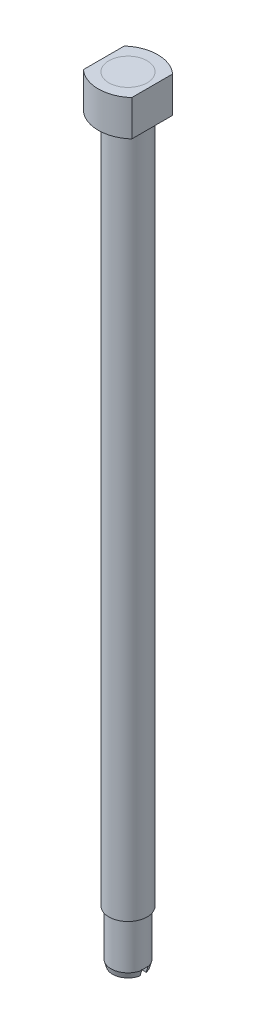
ISO-10303-21;
HEADER;
FILE_DESCRIPTION(('STEP AP214'),'2;1');
FILE_NAME('part.step','',(''),(''),'','','');
FILE_SCHEMA(('AUTOMOTIVE_DESIGN { 1 0 10303 214 1 1 1 1 }'));
ENDSEC;
DATA;
#1=APPLICATION_CONTEXT('core data for automotive mechanical design processes');
#2=APPLICATION_PROTOCOL_DEFINITION('international standard','automotive_design',2000,#1);
#3=PRODUCT_CONTEXT('',#1,'mechanical');
#4=PRODUCT('Part','Part','',(#3));
#5=PRODUCT_RELATED_PRODUCT_CATEGORY('part','',(#4));
#6=PRODUCT_DEFINITION_FORMATION('','',#4);
#7=PRODUCT_DEFINITION_CONTEXT('part definition',#1,'design');
#8=PRODUCT_DEFINITION('design','',#6,#7);
#9=PRODUCT_DEFINITION_SHAPE('','',#8);
#10=(LENGTH_UNIT() NAMED_UNIT(*) SI_UNIT(.MILLI.,.METRE.));
#11=(NAMED_UNIT(*) PLANE_ANGLE_UNIT() SI_UNIT($,.RADIAN.));
#12=(NAMED_UNIT(*) SI_UNIT($,.STERADIAN.) SOLID_ANGLE_UNIT());
#13=UNCERTAINTY_MEASURE_WITH_UNIT(LENGTH_MEASURE(1.E-05),#10,'distance_accuracy_value','');
#14=(GEOMETRIC_REPRESENTATION_CONTEXT(3) GLOBAL_UNCERTAINTY_ASSIGNED_CONTEXT((#13)) GLOBAL_UNIT_ASSIGNED_CONTEXT((#10,
#11,#12)) REPRESENTATION_CONTEXT('',''));
#15=CARTESIAN_POINT('',(0.,0.,0.));
#16=DIRECTION('',(0.,0.,1.));
#17=DIRECTION('',(1.,0.,0.));
#18=AXIS2_PLACEMENT_3D('',#15,#16,#17);
#19=CARTESIAN_POINT('',(0.,113.8174,1.08112685950414));
#20=DIRECTION('',(0.,1.,0.));
#21=DIRECTION('',(0.,0.,1.));
#22=AXIS2_PLACEMENT_3D('',#19,#20,#21);
#23=CYLINDRICAL_SURFACE('',#22,6.00872685950414);
#24=CARTESIAN_POINT('',(0.,119.761,1.08112685950414));
#25=DIRECTION('',(0.,1.,0.));
#26=DIRECTION('',(0.,0.,-1.));
#27=AXIS2_PLACEMENT_3D('',#24,#25,#26);
#28=CIRCLE('',#27,6.00872685950414);
#29=CARTESIAN_POINT('',(4.0132,119.761,-3.3909));
#30=VERTEX_POINT('',#29);
#31=CARTESIAN_POINT('',(-4.0132,119.761,-3.3909));
#32=VERTEX_POINT('',#31);
#33=EDGE_CURVE('E107',#30,#32,#28,.T.);
#34=ORIENTED_EDGE('',*,*,#33,.F.);
#35=DIRECTION('',(0.,1.,0.));
#36=VECTOR('',#35,1.);
#37=CARTESIAN_POINT('',(4.0132,113.8174,-3.3909));
#38=LINE('',#37,#36);
#39=CARTESIAN_POINT('',(4.0132,113.8174,-3.3909));
#40=VERTEX_POINT('',#39);
#41=EDGE_CURVE('E12',#40,#30,#38,.T.);
#42=ORIENTED_EDGE('',*,*,#41,.F.);
#43=CARTESIAN_POINT('',(0.,113.8174,1.08112685950414));
#44=DIRECTION('',(0.,1.,0.));
#45=DIRECTION('',(0.,0.,-1.));
#46=AXIS2_PLACEMENT_3D('',#43,#44,#45);
#47=CIRCLE('',#46,6.00872685950414);
#48=CARTESIAN_POINT('',(-4.0132,113.8174,-3.3909));
#49=VERTEX_POINT('',#48);
#50=EDGE_CURVE('E100',#40,#49,#47,.T.);
#51=ORIENTED_EDGE('',*,*,#50,.T.);
#52=DIRECTION('',(0.,1.,0.));
#53=VECTOR('',#52,1.);
#54=CARTESIAN_POINT('',(-4.0132,113.8174,-3.3909));
#55=LINE('',#54,#53);
#56=EDGE_CURVE('E45',#49,#32,#55,.T.);
#57=ORIENTED_EDGE('',*,*,#56,.T.);
#58=EDGE_LOOP('',(#34,#42,#51,#57));
#59=FACE_BOUND('',#58,.T.);
#60=ADVANCED_FACE('F42',(#59),#23,.T.);
#61=CARTESIAN_POINT('',(4.0132,113.8174,3.3909));
#62=DIRECTION('',(1.,0.,0.));
#63=DIRECTION('',(0.,0.,-1.));
#64=AXIS2_PLACEMENT_3D('',#61,#62,#63);
#65=PLANE('',#64);
#66=DIRECTION('',(0.,0.,-1.));
#67=VECTOR('',#66,1.);
#68=CARTESIAN_POINT('',(4.0132,119.761,3.3909));
#69=LINE('',#68,#67);
#70=CARTESIAN_POINT('',(4.0132,119.761,3.3909));
#71=VERTEX_POINT('',#70);
#72=EDGE_CURVE('E102',#71,#30,#69,.T.);
#73=ORIENTED_EDGE('',*,*,#72,.F.);
#74=DIRECTION('',(0.,1.,0.));
#75=VECTOR('',#74,1.);
#76=CARTESIAN_POINT('',(4.0132,113.8174,3.3909));
#77=LINE('',#76,#75);
#78=CARTESIAN_POINT('',(4.0132,113.8174,3.3909));
#79=VERTEX_POINT('',#78);
#80=EDGE_CURVE('E51',#79,#71,#77,.T.);
#81=ORIENTED_EDGE('',*,*,#80,.F.);
#82=DIRECTION('',(0.,0.,-1.));
#83=VECTOR('',#82,1.);
#84=CARTESIAN_POINT('',(4.0132,113.8174,3.3909));
#85=LINE('',#84,#83);
#86=EDGE_CURVE('E97',#79,#40,#85,.T.);
#87=ORIENTED_EDGE('',*,*,#86,.T.);
#88=ORIENTED_EDGE('',*,*,#41,.T.);
#89=EDGE_LOOP('',(#73,#81,#87,#88));
#90=FACE_BOUND('',#89,.T.);
#91=ADVANCED_FACE('F118',(#90),#65,.T.);
#92=CARTESIAN_POINT('',(0.,113.8174,-1.08112685950413));
#93=DIRECTION('',(0.,1.,0.));
#94=DIRECTION('',(0.,0.,1.));
#95=AXIS2_PLACEMENT_3D('',#92,#93,#94);
#96=CYLINDRICAL_SURFACE('',#95,6.00872685950413);
#97=CARTESIAN_POINT('',(0.,119.761,-1.08112685950413));
#98=DIRECTION('',(0.,1.,0.));
#99=DIRECTION('',(0.,0.,-1.));
#100=AXIS2_PLACEMENT_3D('',#97,#98,#99);
#101=CIRCLE('',#100,6.00872685950413);
#102=CARTESIAN_POINT('',(-4.0132,119.761,3.3909));
#103=VERTEX_POINT('',#102);
#104=EDGE_CURVE('E92',#103,#71,#101,.T.);
#105=ORIENTED_EDGE('',*,*,#104,.F.);
#106=DIRECTION('',(0.,1.,0.));
#107=VECTOR('',#106,1.);
#108=CARTESIAN_POINT('',(-4.0132,113.8174,3.3909));
#109=LINE('',#108,#107);
#110=CARTESIAN_POINT('',(-4.0132,113.8174,3.3909));
#111=VERTEX_POINT('',#110);
#112=EDGE_CURVE('E87',#111,#103,#109,.T.);
#113=ORIENTED_EDGE('',*,*,#112,.F.);
#114=CARTESIAN_POINT('',(0.,113.8174,-1.08112685950413));
#115=DIRECTION('',(0.,1.,0.));
#116=DIRECTION('',(0.,0.,-1.));
#117=AXIS2_PLACEMENT_3D('',#114,#115,#116);
#118=CIRCLE('',#117,6.00872685950413);
#119=EDGE_CURVE('E90',#111,#79,#118,.T.);
#120=ORIENTED_EDGE('',*,*,#119,.T.);
#121=ORIENTED_EDGE('',*,*,#80,.T.);
#122=EDGE_LOOP('',(#105,#113,#120,#121));
#123=FACE_BOUND('',#122,.T.);
#124=ADVANCED_FACE('F89',(#123),#96,.T.);
#125=CARTESIAN_POINT('',(-4.0132,113.8174,3.3909));
#126=DIRECTION('',(-1.,0.,0.));
#127=DIRECTION('',(0.,0.,1.));
#128=AXIS2_PLACEMENT_3D('',#125,#126,#127);
#129=PLANE('',#128);
#130=DIRECTION('',(0.,0.,1.));
#131=VECTOR('',#130,1.);
#132=CARTESIAN_POINT('',(-4.0132,119.761,3.3909));
#133=LINE('',#132,#131);
#134=EDGE_CURVE('E110',#32,#103,#133,.T.);
#135=ORIENTED_EDGE('',*,*,#134,.F.);
#136=ORIENTED_EDGE('',*,*,#56,.F.);
#137=DIRECTION('',(0.,0.,1.));
#138=VECTOR('',#137,1.);
#139=CARTESIAN_POINT('',(-4.0132,113.8174,3.3909));
#140=LINE('',#139,#138);
#141=EDGE_CURVE('E96',#49,#111,#140,.T.);
#142=ORIENTED_EDGE('',*,*,#141,.T.);
#143=ORIENTED_EDGE('',*,*,#112,.T.);
#144=EDGE_LOOP('',(#135,#136,#142,#143));
#145=FACE_BOUND('',#144,.T.);
#146=ADVANCED_FACE('F99',(#145),#129,.T.);
#147=CARTESIAN_POINT('',(0.,113.8174,1.08112685950414));
#148=DIRECTION('',(0.,-1.,0.));
#149=DIRECTION('',(0.,0.,-1.));
#150=AXIS2_PLACEMENT_3D('',#147,#148,#149);
#151=PLANE('',#150);
#152=CARTESIAN_POINT('',(0.,113.8174,0.));
#153=DIRECTION('',(0.,1.,0.));
#154=DIRECTION('',(0.,0.,1.));
#155=AXIS2_PLACEMENT_3D('',#152,#153,#154);
#156=CIRCLE('',#155,3.175);
#157=CARTESIAN_POINT('',(0.,113.8174,3.175));
#158=VERTEX_POINT('',#157);
#159=EDGE_CURVE('E111',#158,#158,#156,.T.);
#160=ORIENTED_EDGE('',*,*,#159,.T.);
#161=EDGE_LOOP('',(#160));
#162=FACE_BOUND('',#161,.T.);
#163=ORIENTED_EDGE('',*,*,#50,.F.);
#164=ORIENTED_EDGE('',*,*,#86,.F.);
#165=ORIENTED_EDGE('',*,*,#119,.F.);
#166=ORIENTED_EDGE('',*,*,#141,.F.);
#167=EDGE_LOOP('',(#163,#164,#165,#166));
#168=FACE_BOUND('',#167,.T.);
#169=ADVANCED_FACE('F95',(#162,#168),#151,.T.);
#170=CARTESIAN_POINT('',(0.,119.761,1.08112685950414));
#171=DIRECTION('',(0.,-1.,0.));
#172=DIRECTION('',(0.,0.,-1.));
#173=AXIS2_PLACEMENT_3D('',#170,#171,#172);
#174=PLANE('',#173);
#175=CARTESIAN_POINT('',(0.,119.761,0.));
#176=DIRECTION('',(0.,1.,0.));
#177=DIRECTION('',(0.,0.,1.));
#178=AXIS2_PLACEMENT_3D('',#175,#176,#177);
#179=CIRCLE('',#178,3.175);
#180=CARTESIAN_POINT('',(0.,119.761,3.175));
#181=VERTEX_POINT('',#180);
#182=EDGE_CURVE('E148',#181,#181,#179,.T.);
#183=ORIENTED_EDGE('',*,*,#182,.F.);
#184=EDGE_LOOP('',(#183));
#185=FACE_BOUND('',#184,.T.);
#186=ORIENTED_EDGE('',*,*,#33,.T.);
#187=ORIENTED_EDGE('',*,*,#134,.T.);
#188=ORIENTED_EDGE('',*,*,#104,.T.);
#189=ORIENTED_EDGE('',*,*,#72,.T.);
#190=EDGE_LOOP('',(#186,#187,#188,#189));
#191=FACE_BOUND('',#190,.T.);
#192=ADVANCED_FACE('F117',(#185,#191),#174,.F.);
#193=CARTESIAN_POINT('',(0.,113.8174,0.));
#194=DIRECTION('',(0.,1.,0.));
#195=DIRECTION('',(0.,0.,1.));
#196=AXIS2_PLACEMENT_3D('',#193,#194,#195);
#197=CYLINDRICAL_SURFACE('',#196,3.175);
#198=ORIENTED_EDGE('',*,*,#159,.F.);
#199=EDGE_LOOP('',(#198));
#200=FACE_BOUND('',#199,.T.);
#201=ORIENTED_EDGE('',*,*,#182,.T.);
#202=EDGE_LOOP('',(#201));
#203=FACE_BOUND('',#202,.T.);
#204=ADVANCED_FACE('F136',(#200,#203),#197,.F.);
#205=CLOSED_SHELL('',(#60,#91,#124,#146,#169,#192,#204));
#206=MANIFOLD_SOLID_BREP('B2',#205);
#207=CARTESIAN_POINT('',(0.,-7.62,0.));
#208=DIRECTION('',(0.,1.,0.));
#209=DIRECTION('',(0.,0.,1.));
#210=AXIS2_PLACEMENT_3D('',#207,#208,#209);
#211=CYLINDRICAL_SURFACE('',#210,2.82287299658198);
#212=CARTESIAN_POINT('',(0.,0.,0.));
#213=DIRECTION('',(0.,1.,0.));
#214=DIRECTION('',(0.,0.,1.));
#215=AXIS2_PLACEMENT_3D('',#212,#213,#214);
#216=CIRCLE('',#215,2.82287299658198);
#217=CARTESIAN_POINT('',(0.,0.,2.82287299658198));
#218=VERTEX_POINT('',#217);
#219=EDGE_CURVE('E269',#218,#218,#216,.F.);
#220=ORIENTED_EDGE('',*,*,#219,.T.);
#221=EDGE_LOOP('',(#220));
#222=FACE_BOUND('',#221,.T.);
#223=DIRECTION('',(0.,1.,0.));
#224=VECTOR('',#223,1.);
#225=CARTESIAN_POINT('',(2.77678734418603,-7.62,-0.508));
#226=LINE('',#225,#224);
#227=CARTESIAN_POINT('',(2.77678734418603,-7.62,-0.508));
#228=VERTEX_POINT('',#227);
#229=CARTESIAN_POINT('',(2.77678734418603,-7.52654586270144,-0.508));
#230=VERTEX_POINT('',#229);
#231=EDGE_CURVE('E312',#228,#230,#226,.T.);
#232=ORIENTED_EDGE('',*,*,#231,.F.);
#233=CARTESIAN_POINT('',(0.,-7.62,0.));
#234=DIRECTION('',(0.,-1.,0.));
#235=DIRECTION('',(0.,0.,-1.));
#236=AXIS2_PLACEMENT_3D('',#233,#234,#235);
#237=CIRCLE('',#236,2.82287299658198);
#238=CARTESIAN_POINT('',(-2.77678734418603,-7.62,-0.508000000000002));
#239=VERTEX_POINT('',#238);
#240=EDGE_CURVE('E254',#239,#228,#237,.T.);
#241=ORIENTED_EDGE('',*,*,#240,.F.);
#242=DIRECTION('',(0.,1.,0.));
#243=VECTOR('',#242,1.);
#244=CARTESIAN_POINT('',(-2.77678734418603,-7.62,-0.508000000000002));
#245=LINE('',#244,#243);
#246=CARTESIAN_POINT('',(-2.77678734418603,-7.52654586270144,-0.508000000000002));
#247=VERTEX_POINT('',#246);
#248=EDGE_CURVE('E209',#247,#239,#245,.F.);
#249=ORIENTED_EDGE('',*,*,#248,.F.);
#250=CARTESIAN_POINT('',(0.,-7.52654586270144,0.));
#251=DIRECTION('',(0.,-1.,0.));
#252=DIRECTION('',(0.,0.,-1.));
#253=AXIS2_PLACEMENT_3D('',#250,#251,#252);
#254=CIRCLE('',#253,2.82287299658198);
#255=CARTESIAN_POINT('',(-2.77678734418603,-7.52654586270144,0.507999999999998));
#256=VERTEX_POINT('',#255);
#257=EDGE_CURVE('E190',#256,#247,#254,.T.);
#258=ORIENTED_EDGE('',*,*,#257,.F.);
#259=DIRECTION('',(0.,1.,0.));
#260=VECTOR('',#259,1.);
#261=CARTESIAN_POINT('',(-2.77678734418603,-7.62,0.507999999999998));
#262=LINE('',#261,#260);
#263=CARTESIAN_POINT('',(-2.77678734418603,-7.62,0.507999999999998));
#264=VERTEX_POINT('',#263);
#265=EDGE_CURVE('E314',#264,#256,#262,.T.);
#266=ORIENTED_EDGE('',*,*,#265,.F.);
#267=CARTESIAN_POINT('',(2.77678734418603,-7.62,0.508));
#268=VERTEX_POINT('',#267);
#269=EDGE_CURVE('E260',#268,#264,#237,.T.);
#270=ORIENTED_EDGE('',*,*,#269,.F.);
#271=DIRECTION('',(0.,1.,0.));
#272=VECTOR('',#271,1.);
#273=CARTESIAN_POINT('',(2.77678734418603,-7.62,0.508));
#274=LINE('',#273,#272);
#275=CARTESIAN_POINT('',(2.77678734418603,-7.52654586270144,0.508));
#276=VERTEX_POINT('',#275);
#277=EDGE_CURVE('E201',#276,#268,#274,.F.);
#278=ORIENTED_EDGE('',*,*,#277,.F.);
#279=EDGE_CURVE('E40',#230,#276,#254,.T.);
#280=ORIENTED_EDGE('',*,*,#279,.F.);
#281=EDGE_LOOP('',(#232,#241,#249,#258,#266,#270,#278,#280));
#282=FACE_BOUND('',#281,.T.);
#283=ADVANCED_FACE('F186',(#222,#282),#211,.T.);
#284=CARTESIAN_POINT('',(0.,-8.54254586270144,-2.56046475852982));
#285=DIRECTION('',(0.,1.,0.));
#286=DIRECTION('',(0.,0.,1.));
#287=AXIS2_PLACEMENT_3D('',#284,#285,#286);
#288=PLANE('',#287);
#289=DIRECTION('',(-1.,0.,0.));
#290=VECTOR('',#289,1.);
#291=CARTESIAN_POINT('',(0.,-8.54254586270144,-0.508000000000001));
#292=LINE('',#291,#290);
#293=CARTESIAN_POINT('',(2.50956485863051,-8.54254586270144,-0.508));
#294=VERTEX_POINT('',#293);
#295=CARTESIAN_POINT('',(-2.50956485863051,-8.54254586270144,-0.508000000000002));
#296=VERTEX_POINT('',#295);
#297=EDGE_CURVE('E238',#294,#296,#292,.T.);
#298=ORIENTED_EDGE('',*,*,#297,.T.);
#299=CARTESIAN_POINT('',(0.,-8.54254586270144,0.));
#300=DIRECTION('',(0.,1.,0.));
#301=DIRECTION('',(0.,0.,1.));
#302=AXIS2_PLACEMENT_3D('',#299,#300,#301);
#303=CIRCLE('',#302,2.56046475852982);
#304=EDGE_CURVE('E252',#294,#296,#303,.T.);
#305=ORIENTED_EDGE('',*,*,#304,.F.);
#306=EDGE_LOOP('',(#298,#305));
#307=FACE_BOUND('',#306,.T.);
#308=ADVANCED_FACE('F257',(#307),#288,.F.);
#309=DIRECTION('',(1.,0.,0.));
#310=VECTOR('',#309,1.);
#311=CARTESIAN_POINT('',(0.,-8.54254586270144,0.507999999999999));
#312=LINE('',#311,#310);
#313=CARTESIAN_POINT('',(-2.50956485863051,-8.54254586270144,0.507999999999998));
#314=VERTEX_POINT('',#313);
#315=CARTESIAN_POINT('',(2.50956485863051,-8.54254586270144,0.508));
#316=VERTEX_POINT('',#315);
#317=EDGE_CURVE('E247',#314,#316,#312,.T.);
#318=ORIENTED_EDGE('',*,*,#317,.T.);
#319=EDGE_CURVE('E258',#314,#316,#303,.T.);
#320=ORIENTED_EDGE('',*,*,#319,.F.);
#321=EDGE_LOOP('',(#318,#320));
#322=FACE_BOUND('',#321,.T.);
#323=ADVANCED_FACE('F327',(#322),#288,.F.);
#324=CARTESIAN_POINT('',(0.,-8.54254586270144,0.));
#325=DIRECTION('',(0.,1.,0.));
#326=DIRECTION('',(0.,0.,1.));
#327=AXIS2_PLACEMENT_3D('',#324,#325,#326);
#328=CONICAL_SURFACE('',#327,2.56046475852982,0.277120440521634);
#329=CARTESIAN_POINT('',(-3.75509140315342,-4.22235165635554,-0.508000000000002));
#330=CARTESIAN_POINT('',(-3.65936682493509,-4.55585016428542,-0.508000000000002));
#331=CARTESIAN_POINT('',(-3.56358296039658,-4.88933163204708,-0.508000000000002));
#332=CARTESIAN_POINT('',(-3.3718598473048,-5.556250045758,-0.508000000000002));
#333=CARTESIAN_POINT('',(-3.27592059868678,-5.88968699168865,-0.508000000000002));
#334=CARTESIAN_POINT('',(-2.98781619232924,-6.88990971485257,-0.508000000000002));
#335=CARTESIAN_POINT('',(-2.79536286716091,-7.55661263186235,-0.508000000000002));
#336=CARTESIAN_POINT('',(-2.50562147958881,-8.55636317439185,-0.508000000000002));
#337=CARTESIAN_POINT('',(-2.40886362574041,-8.88956439846464,-0.508000000000002));
#338=CARTESIAN_POINT('',(-2.2148353637309,-9.5558170416463,-0.508000000000002));
#339=CARTESIAN_POINT('',(-2.11756495643144,-9.88886846100597,-0.508000000000002));
#340=CARTESIAN_POINT('',(-1.92226602735175,-10.5547524487921,-0.508000000000002));
#341=CARTESIAN_POINT('',(-1.82423749908121,-10.8875850153183,-0.508000000000002));
#342=CARTESIAN_POINT('',(-1.67628477373254,-11.3865652700007,-0.508000000000001));
#343=CARTESIAN_POINT('',(-1.62681540384984,-11.5528477192207,-0.508000000000001));
#344=CARTESIAN_POINT('',(-1.52746791254534,-11.8852908187634,-0.508000000000001));
#345=CARTESIAN_POINT('',(-1.47758979022123,-12.0514514688163,-0.508000000000001));
#346=CARTESIAN_POINT('',(-1.42745463611057,-12.2175348735893,-0.508000000000001));
#347=B_SPLINE_CURVE_WITH_KNOTS('',3,(#329,#330,#331,#332,#333,#334,#335,#336,#337,#338,#339,
#340,#341,#342,#343,#344,#345,#346),.UNSPECIFIED.,.F.,.F.,(4,2,2,2,2,2,2,2,4),(0.,
1.04089381012012,2.08178805408325,4.16356014334497,5.20445670209373,6.24535151154004,
7.28625524202892,7.8067100111497,8.32716592947246),.UNSPECIFIED.);
#348=EDGE_CURVE('E243',#239,#296,#347,.T.);
#349=ORIENTED_EDGE('',*,*,#348,.F.);
#350=ORIENTED_EDGE('',*,*,#240,.T.);
#351=CARTESIAN_POINT('',(1.42745463611057,-12.2175348735893,-0.508));
#352=CARTESIAN_POINT('',(1.48475272474168,-12.027710521842,-0.508));
#353=CARTESIAN_POINT('',(1.54171983668693,-11.8377867976167,-0.508));
#354=CARTESIAN_POINT('',(1.65513968029623,-11.4577863075059,-0.508));
#355=CARTESIAN_POINT('',(1.71159241335101,-11.2677095420357,-0.508));
#356=CARTESIAN_POINT('',(1.88040010683767,-10.6973192563528,-0.508));
#357=CARTESIAN_POINT('',(1.9922053288376,-10.3168431906479,-0.508));
#358=CARTESIAN_POINT('',(2.18708464901405,-9.65083688679143,-0.508));
#359=CARTESIAN_POINT('',(2.2703501169459,-9.36536251787649,-0.508));
#360=CARTESIAN_POINT('',(2.43652118293803,-8.79430821577355,-0.508));
#361=CARTESIAN_POINT('',(2.51942678002231,-8.50872828230153,-0.508));
#362=CARTESIAN_POINT('',(2.79536425817509,-7.55660737417558,-0.508));
#363=CARTESIAN_POINT('',(2.98781918626591,-6.88989925266861,-0.508));
#364=CARTESIAN_POINT('',(3.27592437325797,-5.88967392185149,-0.508));
#365=CARTESIAN_POINT('',(3.37186286139037,-5.5562395885999,-0.508));
#366=CARTESIAN_POINT('',(3.56358445634995,-4.88932640075561,-0.508));
#367=CARTESIAN_POINT('',(3.65936756324175,-4.55584754618148,-0.508));
#368=CARTESIAN_POINT('',(3.75509140315342,-4.22235165635554,-0.508));
#369=B_SPLINE_CURVE_WITH_KNOTS('',3,(#351,#352,#353,#354,#355,#356,#357,#358,#359,#360,#361,
#362,#363,#364,#365,#366,#367,#368),.UNSPECIFIED.,.F.,.F.,(4,2,2,2,2,2,2,2,4),(0.,
0.59484952784476,1.18969744692898,2.37938527852458,3.2714942778291,4.16360569508374,
6.24539410877855,7.28628019007867,8.32716583842488),.UNSPECIFIED.);
#370=EDGE_CURVE('E241',#294,#228,#369,.T.);
#371=ORIENTED_EDGE('',*,*,#370,.F.);
#372=ORIENTED_EDGE('',*,*,#304,.T.);
#373=EDGE_LOOP('',(#349,#350,#371,#372));
#374=FACE_BOUND('',#373,.T.);
#375=ADVANCED_FACE('F251',(#374),#328,.T.);
#376=CARTESIAN_POINT('',(-1.42745463611057,-12.2175348735893,0.507999999999999));
#377=CARTESIAN_POINT('',(-1.48475272474168,-12.027710521842,0.507999999999999));
#378=CARTESIAN_POINT('',(-1.54171983668693,-11.8377867976167,0.507999999999999));
#379=CARTESIAN_POINT('',(-1.65513968029623,-11.4577863075059,0.507999999999999));
#380=CARTESIAN_POINT('',(-1.71159241335101,-11.2677095420357,0.507999999999999));
#381=CARTESIAN_POINT('',(-1.88040010683767,-10.6973192563528,0.507999999999999));
#382=CARTESIAN_POINT('',(-1.9922053288376,-10.3168431906479,0.507999999999999));
#383=CARTESIAN_POINT('',(-2.18708464901405,-9.65083688679143,0.507999999999999));
#384=CARTESIAN_POINT('',(-2.2703501169459,-9.36536251787649,0.507999999999998));
#385=CARTESIAN_POINT('',(-2.43652118293803,-8.79430821577355,0.507999999999998));
#386=CARTESIAN_POINT('',(-2.51942678002231,-8.50872828230153,0.507999999999998));
#387=CARTESIAN_POINT('',(-2.79536425817509,-7.55660737417558,0.507999999999998));
#388=CARTESIAN_POINT('',(-2.98781918626591,-6.88989925266861,0.507999999999998));
#389=CARTESIAN_POINT('',(-3.27592437325797,-5.88967392185149,0.507999999999998));
#390=CARTESIAN_POINT('',(-3.37186286139037,-5.5562395885999,0.507999999999998));
#391=CARTESIAN_POINT('',(-3.56358445634995,-4.88932640075561,0.507999999999998));
#392=CARTESIAN_POINT('',(-3.65936756324175,-4.55584754618148,0.507999999999998));
#393=CARTESIAN_POINT('',(-3.75509140315342,-4.22235165635554,0.507999999999998));
#394=B_SPLINE_CURVE_WITH_KNOTS('',3,(#376,#377,#378,#379,#380,#381,#382,#383,#384,#385,#386,
#387,#388,#389,#390,#391,#392,#393),.UNSPECIFIED.,.F.,.F.,(4,2,2,2,2,2,2,2,4),(0.,
0.59484952784476,1.18969744692898,2.37938527852458,3.2714942778291,4.16360569508374,
6.24539410877855,7.28628019007867,8.32716583842488),.UNSPECIFIED.);
#395=EDGE_CURVE('E255',#314,#264,#394,.T.);
#396=ORIENTED_EDGE('',*,*,#395,.F.);
#397=ORIENTED_EDGE('',*,*,#319,.T.);
#398=CARTESIAN_POINT('',(3.75509140315342,-4.22235165635554,0.508));
#399=CARTESIAN_POINT('',(3.65936682493509,-4.55585016428542,0.508));
#400=CARTESIAN_POINT('',(3.56358296039658,-4.88933163204708,0.508));
#401=CARTESIAN_POINT('',(3.3718598473048,-5.556250045758,0.508));
#402=CARTESIAN_POINT('',(3.27592059868678,-5.88968699168865,0.508));
#403=CARTESIAN_POINT('',(2.98781619232924,-6.88990971485257,0.508));
#404=CARTESIAN_POINT('',(2.79536286716091,-7.55661263186235,0.508));
#405=CARTESIAN_POINT('',(2.50562147958881,-8.55636317439185,0.508));
#406=CARTESIAN_POINT('',(2.40886362574041,-8.88956439846464,0.508));
#407=CARTESIAN_POINT('',(2.2148353637309,-9.5558170416463,0.508));
#408=CARTESIAN_POINT('',(2.11756495643144,-9.88886846100597,0.508));
#409=CARTESIAN_POINT('',(1.92226602735175,-10.5547524487921,0.508));
#410=CARTESIAN_POINT('',(1.82423749908122,-10.8875850153183,0.508));
#411=CARTESIAN_POINT('',(1.67628477373254,-11.3865652700007,0.508));
#412=CARTESIAN_POINT('',(1.62681540384984,-11.5528477192207,0.508));
#413=CARTESIAN_POINT('',(1.52746791254534,-11.8852908187634,0.508));
#414=CARTESIAN_POINT('',(1.47758979022123,-12.0514514688163,0.508));
#415=CARTESIAN_POINT('',(1.42745463611057,-12.2175348735893,0.508));
#416=B_SPLINE_CURVE_WITH_KNOTS('',3,(#398,#399,#400,#401,#402,#403,#404,#405,#406,#407,#408,
#409,#410,#411,#412,#413,#414,#415),.UNSPECIFIED.,.F.,.F.,(4,2,2,2,2,2,2,2,4),(0.,
1.04089381012012,2.08178805408325,4.16356014334497,5.20445670209373,6.24535151154004,
7.28625524202892,7.80671001114969,8.32716592947246),.UNSPECIFIED.);
#417=EDGE_CURVE('E275',#268,#316,#416,.T.);
#418=ORIENTED_EDGE('',*,*,#417,.F.);
#419=ORIENTED_EDGE('',*,*,#269,.T.);
#420=EDGE_LOOP('',(#396,#397,#418,#419));
#421=FACE_BOUND('',#420,.T.);
#422=ADVANCED_FACE('F324',(#421),#328,.T.);
#423=CARTESIAN_POINT('',(0.,119.761,0.));
#424=DIRECTION('',(0.,-1.,0.));
#425=DIRECTION('',(0.,0.,-1.));
#426=AXIS2_PLACEMENT_3D('',#423,#424,#425);
#427=CYLINDRICAL_SURFACE('',#426,3.175);
#428=CARTESIAN_POINT('',(0.,119.761,0.));
#429=DIRECTION('',(0.,1.,0.));
#430=DIRECTION('',(0.,0.,1.));
#431=AXIS2_PLACEMENT_3D('',#428,#429,#430);
#432=CIRCLE('',#431,3.175);
#433=CARTESIAN_POINT('',(0.,119.761,3.175));
#434=VERTEX_POINT('',#433);
#435=EDGE_CURVE('E266',#434,#434,#432,.T.);
#436=ORIENTED_EDGE('',*,*,#435,.F.);
#437=EDGE_LOOP('',(#436));
#438=FACE_BOUND('',#437,.T.);
#439=CARTESIAN_POINT('',(0.,0.,0.));
#440=DIRECTION('',(0.,1.,0.));
#441=DIRECTION('',(0.,0.,1.));
#442=AXIS2_PLACEMENT_3D('',#439,#440,#441);
#443=CIRCLE('',#442,3.175);
#444=CARTESIAN_POINT('',(0.,0.,3.175));
#445=VERTEX_POINT('',#444);
#446=EDGE_CURVE('E270',#445,#445,#443,.T.);
#447=ORIENTED_EDGE('',*,*,#446,.T.);
#448=EDGE_LOOP('',(#447));
#449=FACE_BOUND('',#448,.T.);
#450=ADVANCED_FACE('F188',(#438,#449),#427,.T.);
#451=CARTESIAN_POINT('',(0.,119.761,0.));
#452=DIRECTION('',(0.,1.,0.));
#453=DIRECTION('',(0.,0.,1.));
#454=AXIS2_PLACEMENT_3D('',#451,#452,#453);
#455=PLANE('',#454);
#456=ORIENTED_EDGE('',*,*,#435,.T.);
#457=EDGE_LOOP('',(#456));
#458=FACE_BOUND('',#457,.T.);
#459=ADVANCED_FACE('F339',(#458),#455,.T.);
#460=CARTESIAN_POINT('',(0.,0.,0.));
#461=DIRECTION('',(0.,1.,0.));
#462=DIRECTION('',(0.,0.,1.));
#463=AXIS2_PLACEMENT_3D('',#460,#461,#462);
#464=PLANE('',#463);
#465=ORIENTED_EDGE('',*,*,#219,.F.);
#466=EDGE_LOOP('',(#465));
#467=FACE_BOUND('',#466,.T.);
#468=ORIENTED_EDGE('',*,*,#446,.F.);
#469=EDGE_LOOP('',(#468));
#470=FACE_BOUND('',#469,.T.);
#471=ADVANCED_FACE('F341',(#467,#470),#464,.F.);
#472=CARTESIAN_POINT('',(0.,-7.52654586270144,0.));
#473=DIRECTION('',(0.,-1.,0.));
#474=DIRECTION('',(0.,0.,-1.));
#475=AXIS2_PLACEMENT_3D('',#472,#473,#474);
#476=PLANE('',#475);
#477=ORIENTED_EDGE('',*,*,#279,.T.);
#478=DIRECTION('',(1.,0.,0.));
#479=VECTOR('',#478,1.);
#480=CARTESIAN_POINT('',(0.,-7.52654586270144,0.507999999999999));
#481=LINE('',#480,#479);
#482=EDGE_CURVE('E309',#256,#276,#481,.T.);
#483=ORIENTED_EDGE('',*,*,#482,.F.);
#484=ORIENTED_EDGE('',*,*,#257,.T.);
#485=DIRECTION('',(-1.,0.,0.));
#486=VECTOR('',#485,1.);
#487=CARTESIAN_POINT('',(0.,-7.52654586270144,-0.508000000000001));
#488=LINE('',#487,#486);
#489=EDGE_CURVE('E307',#230,#247,#488,.T.);
#490=ORIENTED_EDGE('',*,*,#489,.F.);
#491=EDGE_LOOP('',(#477,#483,#484,#490));
#492=FACE_BOUND('',#491,.T.);
#493=ADVANCED_FACE('F292',(#492),#476,.T.);
#494=CARTESIAN_POINT('',(0.,-7.52654586270144,-0.508000000000001));
#495=DIRECTION('',(0.,0.,1.));
#496=DIRECTION('',(1.,0.,0.));
#497=AXIS2_PLACEMENT_3D('',#494,#495,#496);
#498=PLANE('',#497);
#499=ORIENTED_EDGE('',*,*,#248,.T.);
#500=ORIENTED_EDGE('',*,*,#348,.T.);
#501=ORIENTED_EDGE('',*,*,#297,.F.);
#502=ORIENTED_EDGE('',*,*,#370,.T.);
#503=ORIENTED_EDGE('',*,*,#231,.T.);
#504=ORIENTED_EDGE('',*,*,#489,.T.);
#505=EDGE_LOOP('',(#499,#500,#501,#502,#503,#504));
#506=FACE_BOUND('',#505,.T.);
#507=ADVANCED_FACE('F240',(#506),#498,.T.);
#508=CARTESIAN_POINT('',(0.,-7.52654586270144,0.507999999999999));
#509=DIRECTION('',(0.,0.,-1.));
#510=DIRECTION('',(-1.,0.,0.));
#511=AXIS2_PLACEMENT_3D('',#508,#509,#510);
#512=PLANE('',#511);
#513=ORIENTED_EDGE('',*,*,#265,.T.);
#514=ORIENTED_EDGE('',*,*,#482,.T.);
#515=ORIENTED_EDGE('',*,*,#277,.T.);
#516=ORIENTED_EDGE('',*,*,#417,.T.);
#517=ORIENTED_EDGE('',*,*,#317,.F.);
#518=ORIENTED_EDGE('',*,*,#395,.T.);
#519=EDGE_LOOP('',(#513,#514,#515,#516,#517,#518));
#520=FACE_BOUND('',#519,.T.);
#521=ADVANCED_FACE('F288',(#520),#512,.T.);
#522=CLOSED_SHELL('',(#283,#308,#323,#375,#422,#450,#459,#471,#493,#507,#521));
#523=MANIFOLD_SOLID_BREP('B6',#522);
#524=ADVANCED_BREP_SHAPE_REPRESENTATION('',(#18,#206,#523),#14);
#525=SHAPE_DEFINITION_REPRESENTATION(#9,#524);
ENDSEC;
END-ISO-10303-21;
